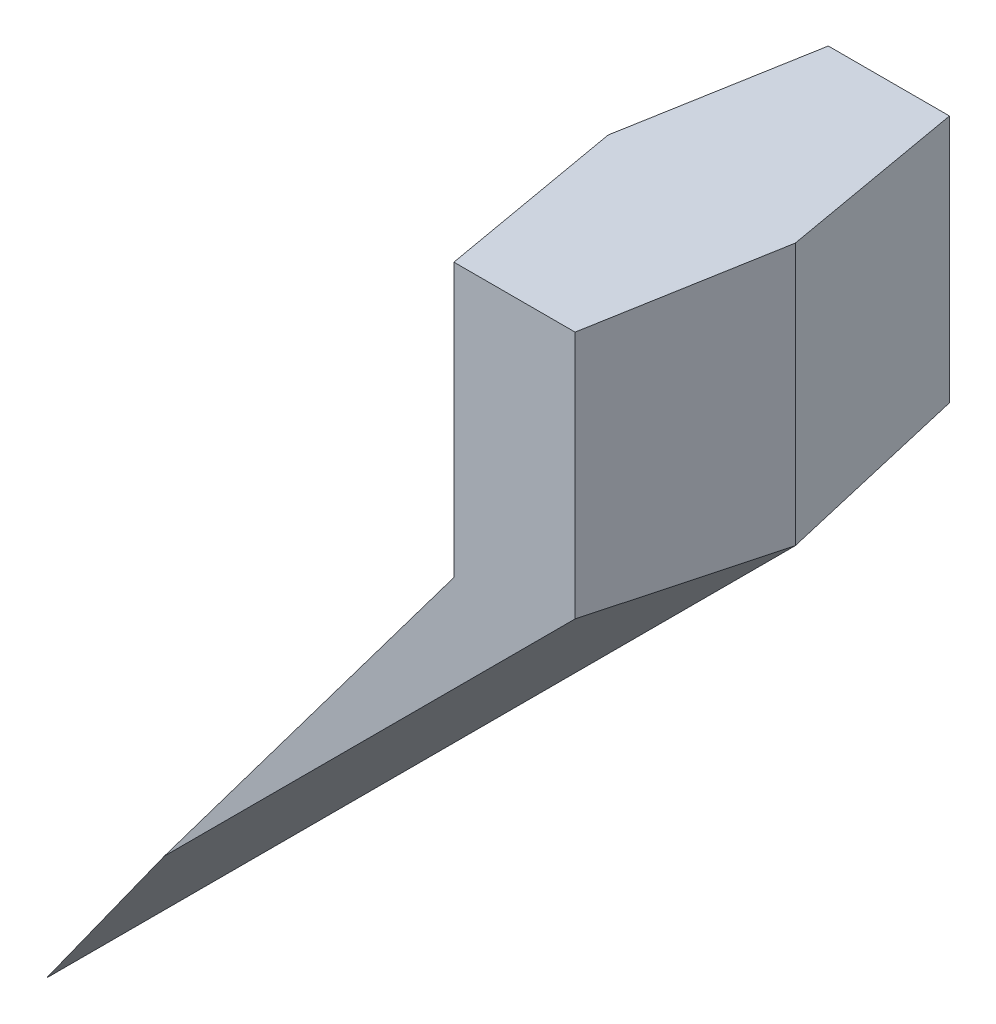
ISO-10303-21;
HEADER;
FILE_DESCRIPTION(('STEP AP214'),'2;1');
FILE_NAME('part.step','',(''),(''),'','','');
FILE_SCHEMA(('AUTOMOTIVE_DESIGN { 1 0 10303 214 1 1 1 1 }'));
ENDSEC;
DATA;
#1=APPLICATION_CONTEXT('core data for automotive mechanical design processes');
#2=APPLICATION_PROTOCOL_DEFINITION('international standard','automotive_design',2000,#1);
#3=PRODUCT_CONTEXT('',#1,'mechanical');
#4=PRODUCT('Part','Part','',(#3));
#5=PRODUCT_RELATED_PRODUCT_CATEGORY('part','',(#4));
#6=PRODUCT_DEFINITION_FORMATION('','',#4);
#7=PRODUCT_DEFINITION_CONTEXT('part definition',#1,'design');
#8=PRODUCT_DEFINITION('design','',#6,#7);
#9=PRODUCT_DEFINITION_SHAPE('','',#8);
#10=(LENGTH_UNIT() NAMED_UNIT(*) SI_UNIT(.MILLI.,.METRE.));
#11=(NAMED_UNIT(*) PLANE_ANGLE_UNIT() SI_UNIT($,.RADIAN.));
#12=(NAMED_UNIT(*) SI_UNIT($,.STERADIAN.) SOLID_ANGLE_UNIT());
#13=UNCERTAINTY_MEASURE_WITH_UNIT(LENGTH_MEASURE(1.E-05),#10,'distance_accuracy_value','');
#14=(GEOMETRIC_REPRESENTATION_CONTEXT(3) GLOBAL_UNCERTAINTY_ASSIGNED_CONTEXT((#13)) GLOBAL_UNIT_ASSIGNED_CONTEXT((#10,
#11,#12)) REPRESENTATION_CONTEXT('',''));
#15=CARTESIAN_POINT('',(0.,0.,0.));
#16=DIRECTION('',(0.,0.,1.));
#17=DIRECTION('',(1.,0.,0.));
#18=AXIS2_PLACEMENT_3D('',#15,#16,#17);
#19=CARTESIAN_POINT('',(-30.0000000000001,-40.,0.));
#20=DIRECTION('',(-0.787846202409765,0.590884651807326,0.173648177666931));
#21=DIRECTION('',(-0.600000000000002,-0.799999999999999,0.));
#22=AXIS2_PLACEMENT_3D('',#19,#20,#21);
#23=PLANE('',#22);
#24=DIRECTION('',(-0.600000000000002,-0.799999999999999,0.));
#25=VECTOR('',#24,1.);
#26=CARTESIAN_POINT('',(-30.0000000000001,-40.,0.));
#27=LINE('',#26,#25);
#28=CARTESIAN_POINT('',(0.,0.,0.));
#29=VERTEX_POINT('',#28);
#30=CARTESIAN_POINT('',(-30.0000000000001,-40.,0.));
#31=VERTEX_POINT('',#30);
#32=EDGE_CURVE('E134',#29,#31,#27,.T.);
#33=ORIENTED_EDGE('',*,*,#32,.T.);
#34=DIRECTION('',(-0.607912736399232,-0.70092927416784,-0.373015090228455));
#35=VECTOR('',#34,1.);
#36=CARTESIAN_POINT('',(1.82646912632396,-3.30377278131376,19.5287128266588));
#37=LINE('',#36,#35);
#38=CARTESIAN_POINT('',(-13.7027307386705,-21.2090906633683,10.));
#39=VERTEX_POINT('',#38);
#40=EDGE_CURVE('E49',#39,#31,#37,.T.);
#41=ORIENTED_EDGE('',*,*,#40,.F.);
#42=DIRECTION('',(0.600000000000002,0.799999999999999,0.));
#43=VECTOR('',#42,1.);
#44=CARTESIAN_POINT('',(1.41061584566772,-1.05796188425079,10.));
#45=LINE('',#44,#43);
#46=CARTESIAN_POINT('',(1.76326980708465,-0.58775660236156,10.));
#47=VERTEX_POINT('',#46);
#48=EDGE_CURVE('E145',#47,#39,#45,.F.);
#49=ORIENTED_EDGE('',*,*,#48,.F.);
#50=DIRECTION('',(-0.173358010306728,0.0577860034355761,-0.983162132137643));
#51=VECTOR('',#50,1.);
#52=CARTESIAN_POINT('',(0.,0.,0.));
#53=LINE('',#52,#51);
#54=EDGE_CURVE('E149',#47,#29,#53,.T.);
#55=ORIENTED_EDGE('',*,*,#54,.T.);
#56=EDGE_LOOP('',(#33,#41,#49,#55));
#57=FACE_BOUND('',#56,.T.);
#58=ADVANCED_FACE('F41',(#57),#23,.T.);
#59=CARTESIAN_POINT('',(10.,0.,0.));
#60=DIRECTION('',(0.696364240320018,-0.69636424032002,0.173648177666931));
#61=DIRECTION('',(0.707106781186549,0.707106781186546,0.));
#62=AXIS2_PLACEMENT_3D('',#59,#60,#61);
#63=PLANE('',#62);
#64=DIRECTION('',(0.707106781186549,0.707106781186546,0.));
#65=VECTOR('',#64,1.);
#66=CARTESIAN_POINT('',(10.,0.,0.));
#67=LINE('',#66,#65);
#68=CARTESIAN_POINT('',(10.,0.,0.));
#69=VERTEX_POINT('',#68);
#70=EDGE_CURVE('E137',#31,#69,#67,.T.);
#71=ORIENTED_EDGE('',*,*,#70,.T.);
#72=DIRECTION('',(0.173200723896954,-0.0717420888509562,-0.982270116581418));
#73=VECTOR('',#72,1.);
#74=CARTESIAN_POINT('',(9.7514843655427,0.102938546253969,1.40940219958846));
#75=LINE('',#74,#73);
#76=CARTESIAN_POINT('',(8.23673019291535,0.730370268217456,10.));
#77=VERTEX_POINT('',#76);
#78=EDGE_CURVE('E148',#77,#69,#75,.T.);
#79=ORIENTED_EDGE('',*,*,#78,.F.);
#80=DIRECTION('',(-0.707106781186549,-0.707106781186546,0.));
#81=VECTOR('',#80,1.);
#82=CARTESIAN_POINT('',(3.75317996234893,-3.75317996234894,10.));
#83=LINE('',#82,#81);
#84=EDGE_CURVE('E155',#39,#77,#83,.F.);
#85=ORIENTED_EDGE('',*,*,#84,.F.);
#86=ORIENTED_EDGE('',*,*,#40,.T.);
#87=EDGE_LOOP('',(#71,#79,#85,#86));
#88=FACE_BOUND('',#87,.T.);
#89=ADVANCED_FACE('F43',(#88),#63,.T.);
#90=CARTESIAN_POINT('',(10.,20.,0.));
#91=DIRECTION('',(0.984807753012208,0.,0.173648177666931));
#92=DIRECTION('',(0.173648177666931,0.,-0.984807753012208));
#93=AXIS2_PLACEMENT_3D('',#90,#91,#92);
#94=PLANE('',#93);
#95=DIRECTION('',(0.,1.,0.));
#96=VECTOR('',#95,1.);
#97=CARTESIAN_POINT('',(10.,20.,0.));
#98=LINE('',#97,#96);
#99=CARTESIAN_POINT('',(10.,14.,0.));
#100=VERTEX_POINT('',#99);
#101=EDGE_CURVE('E141',#69,#100,#98,.T.);
#102=ORIENTED_EDGE('',*,*,#101,.T.);
#103=DIRECTION('',(0.173648177666931,0.,-0.984807753012208));
#104=VECTOR('',#103,1.);
#105=CARTESIAN_POINT('',(10.,14.,0.));
#106=LINE('',#105,#104);
#107=CARTESIAN_POINT('',(8.23673019291535,14.,10.));
#108=VERTEX_POINT('',#107);
#109=EDGE_CURVE('E165',#100,#108,#106,.F.);
#110=ORIENTED_EDGE('',*,*,#109,.T.);
#111=DIRECTION('',(0.,-1.,0.));
#112=VECTOR('',#111,1.);
#113=CARTESIAN_POINT('',(8.23673019291535,0.,10.));
#114=LINE('',#113,#112);
#115=EDGE_CURVE('E157',#77,#108,#114,.F.);
#116=ORIENTED_EDGE('',*,*,#115,.F.);
#117=ORIENTED_EDGE('',*,*,#78,.T.);
#118=EDGE_LOOP('',(#102,#110,#116,#117));
#119=FACE_BOUND('',#118,.T.);
#120=ADVANCED_FACE('F164',(#119),#94,.T.);
#121=CARTESIAN_POINT('',(0.,0.,0.));
#122=DIRECTION('',(-0.984807753012208,0.,0.173648177666931));
#123=DIRECTION('',(0.173648177666931,0.,0.984807753012208));
#124=AXIS2_PLACEMENT_3D('',#121,#122,#123);
#125=PLANE('',#124);
#126=DIRECTION('',(0.,1.,0.));
#127=VECTOR('',#126,1.);
#128=CARTESIAN_POINT('',(1.76326980708465,0.,10.));
#129=LINE('',#128,#127);
#130=CARTESIAN_POINT('',(1.76326980708465,14.,10.));
#131=VERTEX_POINT('',#130);
#132=EDGE_CURVE('E63',#131,#47,#129,.F.);
#133=ORIENTED_EDGE('',*,*,#132,.F.);
#134=DIRECTION('',(0.173648177666931,0.,0.984807753012208));
#135=VECTOR('',#134,1.);
#136=CARTESIAN_POINT('',(0.,14.,0.));
#137=LINE('',#136,#135);
#138=CARTESIAN_POINT('',(0.,14.,0.));
#139=VERTEX_POINT('',#138);
#140=EDGE_CURVE('E116',#131,#139,#137,.F.);
#141=ORIENTED_EDGE('',*,*,#140,.T.);
#142=DIRECTION('',(0.,-1.,0.));
#143=VECTOR('',#142,1.);
#144=CARTESIAN_POINT('',(0.,0.,0.));
#145=LINE('',#144,#143);
#146=EDGE_CURVE('E115',#139,#29,#145,.T.);
#147=ORIENTED_EDGE('',*,*,#146,.T.);
#148=ORIENTED_EDGE('',*,*,#54,.F.);
#149=EDGE_LOOP('',(#133,#141,#147,#148));
#150=FACE_BOUND('',#149,.T.);
#151=ADVANCED_FACE('F201',(#150),#125,.T.);
#152=CARTESIAN_POINT('',(0.,0.,10.));
#153=DIRECTION('',(0.,0.,-1.));
#154=DIRECTION('',(-1.,0.,0.));
#155=AXIS2_PLACEMENT_3D('',#152,#153,#154);
#156=PLANE('',#155);
#157=ORIENTED_EDGE('',*,*,#115,.T.);
#158=DIRECTION('',(-1.,0.,0.));
#159=VECTOR('',#158,1.);
#160=CARTESIAN_POINT('',(0.,14.,10.));
#161=LINE('',#160,#159);
#162=EDGE_CURVE('E127',#108,#131,#161,.T.);
#163=ORIENTED_EDGE('',*,*,#162,.T.);
#164=ORIENTED_EDGE('',*,*,#132,.T.);
#165=ORIENTED_EDGE('',*,*,#48,.T.);
#166=ORIENTED_EDGE('',*,*,#84,.T.);
#167=EDGE_LOOP('',(#157,#163,#164,#165,#166));
#168=FACE_BOUND('',#167,.T.);
#169=ADVANCED_FACE('F160',(#168),#156,.F.);
#170=CARTESIAN_POINT('',(-30.0000000000001,-40.,0.));
#171=DIRECTION('',(-0.787846202409765,0.590884651807326,-0.173648177666931));
#172=DIRECTION('',(-0.600000000000002,-0.799999999999999,0.));
#173=AXIS2_PLACEMENT_3D('',#170,#171,#172);
#174=PLANE('',#173);
#175=ORIENTED_EDGE('',*,*,#32,.F.);
#176=DIRECTION('',(-0.173358010306728,0.0577860034355761,0.983162132137643));
#177=VECTOR('',#176,1.);
#178=CARTESIAN_POINT('',(-0.500883328958458,0.166961109652829,2.84065051727172));
#179=LINE('',#178,#177);
#180=CARTESIAN_POINT('',(1.76326980708465,-0.58775660236156,-10.));
#181=VERTEX_POINT('',#180);
#182=EDGE_CURVE('E138',#181,#29,#179,.T.);
#183=ORIENTED_EDGE('',*,*,#182,.F.);
#184=DIRECTION('',(-0.600000000000002,-0.799999999999999,0.));
#185=VECTOR('',#184,1.);
#186=CARTESIAN_POINT('',(1.41061584566772,-1.05796188425079,-10.));
#187=LINE('',#186,#185);
#188=CARTESIAN_POINT('',(-13.7027307386705,-21.2090906633683,-10.));
#189=VERTEX_POINT('',#188);
#190=EDGE_CURVE('E122',#181,#189,#187,.T.);
#191=ORIENTED_EDGE('',*,*,#190,.T.);
#192=DIRECTION('',(-0.607912736399232,-0.70092927416784,0.373015090228455));
#193=VECTOR('',#192,1.);
#194=CARTESIAN_POINT('',(-30.0000000000001,-40.,0.));
#195=LINE('',#194,#193);
#196=EDGE_CURVE('E133',#189,#31,#195,.T.);
#197=ORIENTED_EDGE('',*,*,#196,.T.);
#198=EDGE_LOOP('',(#175,#183,#191,#197));
#199=FACE_BOUND('',#198,.T.);
#200=ADVANCED_FACE('F183',(#199),#174,.T.);
#201=CARTESIAN_POINT('',(0.,0.,0.));
#202=DIRECTION('',(-0.984807753012208,0.,-0.173648177666931));
#203=DIRECTION('',(-0.173648177666931,0.,0.984807753012208));
#204=AXIS2_PLACEMENT_3D('',#201,#202,#203);
#205=PLANE('',#204);
#206=DIRECTION('',(-0.173648177666931,0.,0.984807753012208));
#207=VECTOR('',#206,1.);
#208=CARTESIAN_POINT('',(0.,14.,0.));
#209=LINE('',#208,#207);
#210=CARTESIAN_POINT('',(1.76326980708465,14.,-10.));
#211=VERTEX_POINT('',#210);
#212=EDGE_CURVE('E103',#211,#139,#209,.T.);
#213=ORIENTED_EDGE('',*,*,#212,.F.);
#214=DIRECTION('',(0.,-1.,0.));
#215=VECTOR('',#214,1.);
#216=CARTESIAN_POINT('',(1.76326980708465,0.,-10.));
#217=LINE('',#216,#215);
#218=EDGE_CURVE('E113',#211,#181,#217,.T.);
#219=ORIENTED_EDGE('',*,*,#218,.T.);
#220=ORIENTED_EDGE('',*,*,#182,.T.);
#221=ORIENTED_EDGE('',*,*,#146,.F.);
#222=EDGE_LOOP('',(#213,#219,#220,#221));
#223=FACE_BOUND('',#222,.T.);
#224=ADVANCED_FACE('F111',(#223),#205,.T.);
#225=CARTESIAN_POINT('',(10.,20.,0.));
#226=DIRECTION('',(0.984807753012208,0.,-0.173648177666931));
#227=DIRECTION('',(-0.173648177666931,0.,-0.984807753012208));
#228=AXIS2_PLACEMENT_3D('',#225,#226,#227);
#229=PLANE('',#228);
#230=DIRECTION('',(-0.173648177666931,0.,-0.984807753012208));
#231=VECTOR('',#230,1.);
#232=CARTESIAN_POINT('',(10.,14.,0.));
#233=LINE('',#232,#231);
#234=CARTESIAN_POINT('',(8.23673019291535,14.,-10.));
#235=VERTEX_POINT('',#234);
#236=EDGE_CURVE('E56',#100,#235,#233,.T.);
#237=ORIENTED_EDGE('',*,*,#236,.F.);
#238=ORIENTED_EDGE('',*,*,#101,.F.);
#239=DIRECTION('',(0.173200723896954,-0.0717420888509562,0.982270116581418));
#240=VECTOR('',#239,1.);
#241=CARTESIAN_POINT('',(10.,0.,0.));
#242=LINE('',#241,#240);
#243=CARTESIAN_POINT('',(8.23673019291535,0.730370268217456,-10.));
#244=VERTEX_POINT('',#243);
#245=EDGE_CURVE('E171',#244,#69,#242,.T.);
#246=ORIENTED_EDGE('',*,*,#245,.F.);
#247=DIRECTION('',(0.,1.,0.));
#248=VECTOR('',#247,1.);
#249=CARTESIAN_POINT('',(8.23673019291535,0.,-10.));
#250=LINE('',#249,#248);
#251=EDGE_CURVE('E123',#244,#235,#250,.T.);
#252=ORIENTED_EDGE('',*,*,#251,.T.);
#253=EDGE_LOOP('',(#237,#238,#246,#252));
#254=FACE_BOUND('',#253,.T.);
#255=ADVANCED_FACE('F184',(#254),#229,.T.);
#256=CARTESIAN_POINT('',(10.,0.,0.));
#257=DIRECTION('',(0.696364240320018,-0.69636424032002,-0.173648177666931));
#258=DIRECTION('',(0.707106781186549,0.707106781186546,0.));
#259=AXIS2_PLACEMENT_3D('',#256,#257,#258);
#260=PLANE('',#259);
#261=ORIENTED_EDGE('',*,*,#70,.F.);
#262=ORIENTED_EDGE('',*,*,#196,.F.);
#263=DIRECTION('',(0.707106781186549,0.707106781186546,0.));
#264=VECTOR('',#263,1.);
#265=CARTESIAN_POINT('',(3.75317996234893,-3.75317996234894,-10.));
#266=LINE('',#265,#264);
#267=EDGE_CURVE('E125',#189,#244,#266,.T.);
#268=ORIENTED_EDGE('',*,*,#267,.T.);
#269=ORIENTED_EDGE('',*,*,#245,.T.);
#270=EDGE_LOOP('',(#261,#262,#268,#269));
#271=FACE_BOUND('',#270,.T.);
#272=ADVANCED_FACE('F175',(#271),#260,.T.);
#273=CARTESIAN_POINT('',(0.,0.,-10.));
#274=DIRECTION('',(0.,0.,1.));
#275=DIRECTION('',(-1.,0.,0.));
#276=AXIS2_PLACEMENT_3D('',#273,#274,#275);
#277=PLANE('',#276);
#278=ORIENTED_EDGE('',*,*,#218,.F.);
#279=DIRECTION('',(1.,0.,0.));
#280=VECTOR('',#279,1.);
#281=CARTESIAN_POINT('',(0.,14.,-10.));
#282=LINE('',#281,#280);
#283=EDGE_CURVE('E11',#211,#235,#282,.T.);
#284=ORIENTED_EDGE('',*,*,#283,.T.);
#285=ORIENTED_EDGE('',*,*,#251,.F.);
#286=ORIENTED_EDGE('',*,*,#267,.F.);
#287=ORIENTED_EDGE('',*,*,#190,.F.);
#288=EDGE_LOOP('',(#278,#284,#285,#286,#287));
#289=FACE_BOUND('',#288,.T.);
#290=ADVANCED_FACE('F119',(#289),#277,.F.);
#291=CARTESIAN_POINT('',(26.4281326830379,14.,-50.));
#292=DIRECTION('',(0.,-1.,0.));
#293=DIRECTION('',(1.,0.,0.));
#294=AXIS2_PLACEMENT_3D('',#291,#292,#293);
#295=PLANE('',#294);
#296=ORIENTED_EDGE('',*,*,#109,.F.);
#297=ORIENTED_EDGE('',*,*,#236,.T.);
#298=ORIENTED_EDGE('',*,*,#283,.F.);
#299=ORIENTED_EDGE('',*,*,#212,.T.);
#300=ORIENTED_EDGE('',*,*,#140,.F.);
#301=ORIENTED_EDGE('',*,*,#162,.F.);
#302=EDGE_LOOP('',(#296,#297,#298,#299,#300,#301));
#303=FACE_BOUND('',#302,.T.);
#304=ADVANCED_FACE('F102',(#303),#295,.F.);
#305=CLOSED_SHELL('',(#58,#89,#120,#151,#169,#200,#224,#255,#272,#290,#304));
#306=MANIFOLD_SOLID_BREP('B2',#305);
#307=ADVANCED_BREP_SHAPE_REPRESENTATION('',(#18,#306),#14);
#308=SHAPE_DEFINITION_REPRESENTATION(#9,#307);
ENDSEC;
END-ISO-10303-21;
